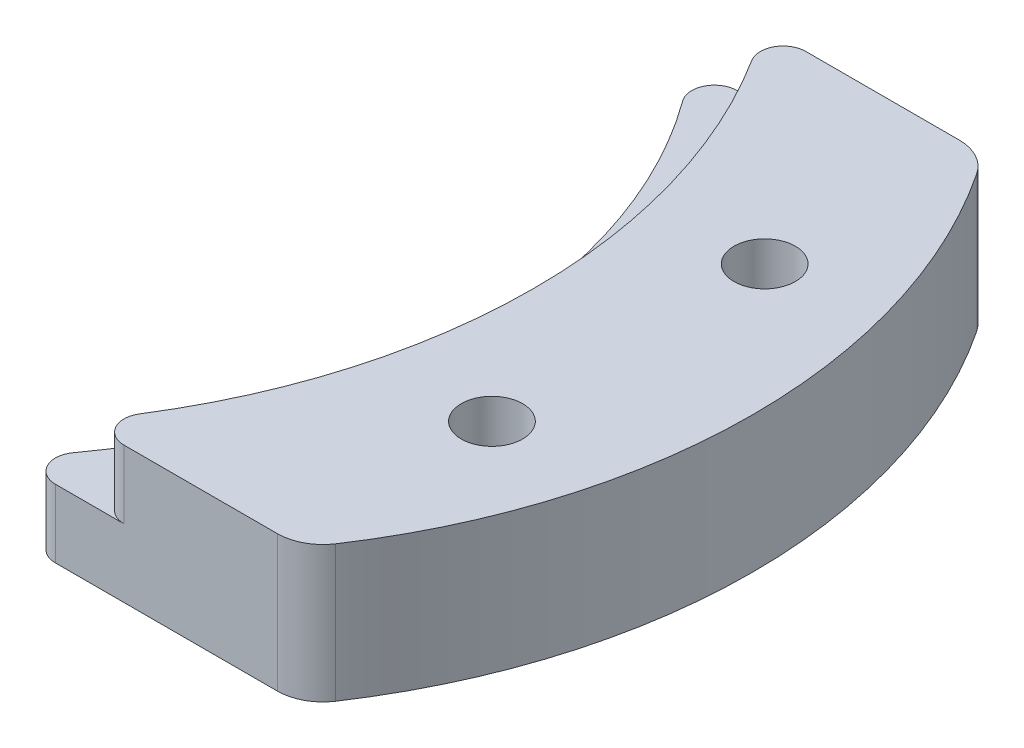
ISO-10303-21;
HEADER;
FILE_DESCRIPTION(('STEP AP214'),'2;1');
FILE_NAME('part.step','',(''),(''),'','','');
FILE_SCHEMA(('AUTOMOTIVE_DESIGN { 1 0 10303 214 1 1 1 1 }'));
ENDSEC;
DATA;
#1=APPLICATION_CONTEXT('core data for automotive mechanical design processes');
#2=APPLICATION_PROTOCOL_DEFINITION('international standard','automotive_design',2000,#1);
#3=PRODUCT_CONTEXT('',#1,'mechanical');
#4=PRODUCT('Part','Part','',(#3));
#5=PRODUCT_RELATED_PRODUCT_CATEGORY('part','',(#4));
#6=PRODUCT_DEFINITION_FORMATION('','',#4);
#7=PRODUCT_DEFINITION_CONTEXT('part definition',#1,'design');
#8=PRODUCT_DEFINITION('design','',#6,#7);
#9=PRODUCT_DEFINITION_SHAPE('','',#8);
#10=(LENGTH_UNIT() NAMED_UNIT(*) SI_UNIT(.MILLI.,.METRE.));
#11=(NAMED_UNIT(*) PLANE_ANGLE_UNIT() SI_UNIT($,.RADIAN.));
#12=(NAMED_UNIT(*) SI_UNIT($,.STERADIAN.) SOLID_ANGLE_UNIT());
#13=UNCERTAINTY_MEASURE_WITH_UNIT(LENGTH_MEASURE(1.E-05),#10,'distance_accuracy_value','');
#14=(GEOMETRIC_REPRESENTATION_CONTEXT(3) GLOBAL_UNCERTAINTY_ASSIGNED_CONTEXT((#13)) GLOBAL_UNIT_ASSIGNED_CONTEXT((#10,
#11,#12)) REPRESENTATION_CONTEXT('',''));
#15=CARTESIAN_POINT('',(0.,0.,0.));
#16=DIRECTION('',(0.,0.,1.));
#17=DIRECTION('',(1.,0.,0.));
#18=AXIS2_PLACEMENT_3D('',#15,#16,#17);
#19=CARTESIAN_POINT('',(0.,6.,0.));
#20=DIRECTION('',(0.,-1.,0.));
#21=DIRECTION('',(0.,0.,-1.));
#22=AXIS2_PLACEMENT_3D('',#19,#20,#21);
#23=CYLINDRICAL_SURFACE('',#22,22.75);
#24=CARTESIAN_POINT('',(0.,3.,0.));
#25=DIRECTION('',(0.,1.,0.));
#26=DIRECTION('',(0.,0.,1.));
#27=AXIS2_PLACEMENT_3D('',#24,#25,#26);
#28=CIRCLE('',#27,22.75);
#29=CARTESIAN_POINT('',(18.3771674621939,3.,13.4105263157895));
#30=VERTEX_POINT('',#29);
#31=CARTESIAN_POINT('',(18.3771674621939,3.,-13.4105263157895));
#32=VERTEX_POINT('',#31);
#33=EDGE_CURVE('E148',#30,#32,#28,.T.);
#34=ORIENTED_EDGE('',*,*,#33,.T.);
#35=DIRECTION('',(0.,-1.,0.));
#36=VECTOR('',#35,1.);
#37=CARTESIAN_POINT('',(18.3771674621939,6.,-13.4105263157895));
#38=LINE('',#37,#36);
#39=CARTESIAN_POINT('',(18.3771674621939,0.,-13.4105263157895));
#40=VERTEX_POINT('',#39);
#41=EDGE_CURVE('E163',#32,#40,#38,.T.);
#42=ORIENTED_EDGE('',*,*,#41,.T.);
#43=CARTESIAN_POINT('',(0.,0.,0.));
#44=DIRECTION('',(0.,1.,0.));
#45=DIRECTION('',(0.,0.,1.));
#46=AXIS2_PLACEMENT_3D('',#43,#44,#45);
#47=CIRCLE('',#46,22.75);
#48=CARTESIAN_POINT('',(18.3771674621939,0.,13.4105263157895));
#49=VERTEX_POINT('',#48);
#50=EDGE_CURVE('E255',#49,#40,#47,.T.);
#51=ORIENTED_EDGE('',*,*,#50,.F.);
#52=DIRECTION('',(0.,-1.,0.));
#53=VECTOR('',#52,1.);
#54=CARTESIAN_POINT('',(18.3771674621939,6.,13.4105263157895));
#55=LINE('',#54,#53);
#56=EDGE_CURVE('E156',#49,#30,#55,.F.);
#57=ORIENTED_EDGE('',*,*,#56,.T.);
#58=EDGE_LOOP('',(#34,#42,#51,#57));
#59=FACE_BOUND('',#58,.T.);
#60=ADVANCED_FACE('F36',(#59),#23,.F.);
#61=CARTESIAN_POINT('',(0.,6.,15.));
#62=DIRECTION('',(0.,0.,-1.));
#63=DIRECTION('',(-1.,0.,0.));
#64=AXIS2_PLACEMENT_3D('',#61,#62,#63);
#65=PLANE('',#64);
#66=DIRECTION('',(1.,0.,0.));
#67=VECTOR('',#66,1.);
#68=CARTESIAN_POINT('',(0.,0.,15.));
#69=LINE('',#68,#67);
#70=CARTESIAN_POINT('',(19.1849550429497,0.,15.));
#71=VERTEX_POINT('',#70);
#72=CARTESIAN_POINT('',(28.9551813231506,0.,15.));
#73=VERTEX_POINT('',#72);
#74=EDGE_CURVE('E236',#71,#73,#69,.T.);
#75=ORIENTED_EDGE('',*,*,#74,.T.);
#76=DIRECTION('',(0.,1.,0.));
#77=VECTOR('',#76,1.);
#78=CARTESIAN_POINT('',(28.9551813231506,6.,15.));
#79=LINE('',#78,#77);
#80=CARTESIAN_POINT('',(28.9551813231506,6.,15.));
#81=VERTEX_POINT('',#80);
#82=EDGE_CURVE('E51',#73,#81,#79,.T.);
#83=ORIENTED_EDGE('',*,*,#82,.T.);
#84=DIRECTION('',(1.,0.,0.));
#85=VECTOR('',#84,1.);
#86=CARTESIAN_POINT('',(0.,6.,15.));
#87=LINE('',#86,#85);
#88=CARTESIAN_POINT('',(22.2050106957867,6.,15.));
#89=VERTEX_POINT('',#88);
#90=EDGE_CURVE('E231',#89,#81,#87,.T.);
#91=ORIENTED_EDGE('',*,*,#90,.F.);
#92=DIRECTION('',(0.,1.,0.));
#93=VECTOR('',#92,1.);
#94=CARTESIAN_POINT('',(22.2050106957867,6.,15.));
#95=LINE('',#94,#93);
#96=CARTESIAN_POINT('',(22.2050106957867,3.,15.));
#97=VERTEX_POINT('',#96);
#98=EDGE_CURVE('E153',#89,#97,#95,.F.);
#99=ORIENTED_EDGE('',*,*,#98,.T.);
#100=DIRECTION('',(1.,0.,0.));
#101=VECTOR('',#100,1.);
#102=CARTESIAN_POINT('',(0.,3.,15.));
#103=LINE('',#102,#101);
#104=CARTESIAN_POINT('',(19.1849550429497,3.,15.));
#105=VERTEX_POINT('',#104);
#106=EDGE_CURVE('E258',#105,#97,#103,.T.);
#107=ORIENTED_EDGE('',*,*,#106,.F.);
#108=DIRECTION('',(0.,1.,0.));
#109=VECTOR('',#108,1.);
#110=CARTESIAN_POINT('',(19.1849550429497,0.,15.));
#111=LINE('',#110,#109);
#112=EDGE_CURVE('E174',#105,#71,#111,.F.);
#113=ORIENTED_EDGE('',*,*,#112,.T.);
#114=EDGE_LOOP('',(#75,#83,#91,#99,#107,#113));
#115=FACE_BOUND('',#114,.T.);
#116=ADVANCED_FACE('F292',(#115),#65,.F.);
#117=CARTESIAN_POINT('',(9.37840937269872,6.,0.));
#118=DIRECTION('',(0.,-1.,0.));
#119=DIRECTION('',(0.,0.,-1.));
#120=AXIS2_PLACEMENT_3D('',#117,#118,#119);
#121=CYLINDRICAL_SURFACE('',#120,25.5);
#122=CARTESIAN_POINT('',(9.37840937269872,0.,0.));
#123=DIRECTION('',(0.,1.,0.));
#124=DIRECTION('',(0.,0.,1.));
#125=AXIS2_PLACEMENT_3D('',#122,#123,#124);
#126=CIRCLE('',#125,25.5);
#127=CARTESIAN_POINT('',(30.6212895742529,0.,-14.1063829787234));
#128=VERTEX_POINT('',#127);
#129=CARTESIAN_POINT('',(30.6212895742529,0.,14.1063829787234));
#130=VERTEX_POINT('',#129);
#131=EDGE_CURVE('E232',#128,#130,#126,.F.);
#132=ORIENTED_EDGE('',*,*,#131,.F.);
#133=DIRECTION('',(0.,-1.,0.));
#134=VECTOR('',#133,1.);
#135=CARTESIAN_POINT('',(30.6212895742529,6.,-14.1063829787234));
#136=LINE('',#135,#134);
#137=CARTESIAN_POINT('',(30.6212895742529,6.,-14.1063829787234));
#138=VERTEX_POINT('',#137);
#139=EDGE_CURVE('E193',#128,#138,#136,.F.);
#140=ORIENTED_EDGE('',*,*,#139,.T.);
#141=CARTESIAN_POINT('',(9.37840937269872,6.,0.));
#142=DIRECTION('',(0.,1.,0.));
#143=DIRECTION('',(0.,0.,1.));
#144=AXIS2_PLACEMENT_3D('',#141,#142,#143);
#145=CIRCLE('',#144,25.5);
#146=CARTESIAN_POINT('',(30.6212895742529,6.,14.1063829787234));
#147=VERTEX_POINT('',#146);
#148=EDGE_CURVE('E234',#138,#147,#145,.F.);
#149=ORIENTED_EDGE('',*,*,#148,.T.);
#150=DIRECTION('',(0.,-1.,0.));
#151=VECTOR('',#150,1.);
#152=CARTESIAN_POINT('',(30.6212895742529,6.,14.1063829787234));
#153=LINE('',#152,#151);
#154=EDGE_CURVE('E190',#147,#130,#153,.T.);
#155=ORIENTED_EDGE('',*,*,#154,.T.);
#156=EDGE_LOOP('',(#132,#140,#149,#155));
#157=FACE_BOUND('',#156,.T.);
#158=ADVANCED_FACE('F297',(#157),#121,.T.);
#159=CARTESIAN_POINT('',(0.,6.,-15.));
#160=DIRECTION('',(0.,0.,-1.));
#161=DIRECTION('',(-1.,0.,0.));
#162=AXIS2_PLACEMENT_3D('',#159,#160,#161);
#163=PLANE('',#162);
#164=DIRECTION('',(1.,0.,0.));
#165=VECTOR('',#164,1.);
#166=CARTESIAN_POINT('',(0.,6.,-15.));
#167=LINE('',#166,#165);
#168=CARTESIAN_POINT('',(22.2050106957867,6.,-15.));
#169=VERTEX_POINT('',#168);
#170=CARTESIAN_POINT('',(28.9551813231506,6.,-15.));
#171=VERTEX_POINT('',#170);
#172=EDGE_CURVE('E240',#169,#171,#167,.T.);
#173=ORIENTED_EDGE('',*,*,#172,.T.);
#174=DIRECTION('',(0.,-1.,0.));
#175=VECTOR('',#174,1.);
#176=CARTESIAN_POINT('',(28.9551813231506,6.,-15.));
#177=LINE('',#176,#175);
#178=CARTESIAN_POINT('',(28.9551813231506,0.,-15.));
#179=VERTEX_POINT('',#178);
#180=EDGE_CURVE('E183',#171,#179,#177,.T.);
#181=ORIENTED_EDGE('',*,*,#180,.T.);
#182=DIRECTION('',(1.,0.,0.));
#183=VECTOR('',#182,1.);
#184=CARTESIAN_POINT('',(0.,0.,-15.));
#185=LINE('',#184,#183);
#186=CARTESIAN_POINT('',(19.1849550429497,0.,-15.));
#187=VERTEX_POINT('',#186);
#188=EDGE_CURVE('E225',#187,#179,#185,.T.);
#189=ORIENTED_EDGE('',*,*,#188,.F.);
#190=DIRECTION('',(0.,-1.,0.));
#191=VECTOR('',#190,1.);
#192=CARTESIAN_POINT('',(19.1849550429497,6.,-15.));
#193=LINE('',#192,#191);
#194=CARTESIAN_POINT('',(19.1849550429497,3.,-15.));
#195=VERTEX_POINT('',#194);
#196=EDGE_CURVE('E158',#187,#195,#193,.F.);
#197=ORIENTED_EDGE('',*,*,#196,.T.);
#198=DIRECTION('',(1.,0.,0.));
#199=VECTOR('',#198,1.);
#200=CARTESIAN_POINT('',(0.,3.,-15.));
#201=LINE('',#200,#199);
#202=CARTESIAN_POINT('',(22.2050106957867,3.,-15.));
#203=VERTEX_POINT('',#202);
#204=EDGE_CURVE('E141',#195,#203,#201,.T.);
#205=ORIENTED_EDGE('',*,*,#204,.T.);
#206=DIRECTION('',(0.,-1.,0.));
#207=VECTOR('',#206,1.);
#208=CARTESIAN_POINT('',(22.2050106957867,6.,-15.));
#209=LINE('',#208,#207);
#210=EDGE_CURVE('E154',#203,#169,#209,.F.);
#211=ORIENTED_EDGE('',*,*,#210,.T.);
#212=EDGE_LOOP('',(#173,#181,#189,#197,#205,#211));
#213=FACE_BOUND('',#212,.T.);
#214=ADVANCED_FACE('F244',(#213),#163,.T.);
#215=CARTESIAN_POINT('',(0.,6.,0.));
#216=DIRECTION('',(0.,1.,0.));
#217=DIRECTION('',(0.,0.,1.));
#218=AXIS2_PLACEMENT_3D('',#215,#216,#217);
#219=PLANE('',#218);
#220=CARTESIAN_POINT('',(29.3938769133981,6.,-6.));
#221=DIRECTION('',(0.,1.,0.));
#222=DIRECTION('',(0.,0.,1.));
#223=AXIS2_PLACEMENT_3D('',#220,#221,#222);
#224=CIRCLE('',#223,1.35);
#225=CARTESIAN_POINT('',(29.3938769133981,6.,-4.65));
#226=VERTEX_POINT('',#225);
#227=EDGE_CURVE('E266',#226,#226,#224,.T.);
#228=ORIENTED_EDGE('',*,*,#227,.F.);
#229=EDGE_LOOP('',(#228));
#230=FACE_BOUND('',#229,.T.);
#231=CARTESIAN_POINT('',(29.3938769133981,6.,6.));
#232=DIRECTION('',(0.,1.,0.));
#233=DIRECTION('',(0.,0.,-1.));
#234=AXIS2_PLACEMENT_3D('',#231,#232,#233);
#235=CIRCLE('',#234,1.35);
#236=CARTESIAN_POINT('',(29.3938769133981,6.,4.65));
#237=VERTEX_POINT('',#236);
#238=EDGE_CURVE('E267',#237,#237,#235,.T.);
#239=ORIENTED_EDGE('',*,*,#238,.F.);
#240=EDGE_LOOP('',(#239));
#241=FACE_BOUND('',#240,.T.);
#242=ORIENTED_EDGE('',*,*,#148,.F.);
#243=CARTESIAN_POINT('',(28.9551813231506,6.,-13.));
#244=DIRECTION('',(0.,1.,0.));
#245=DIRECTION('',(0.,0.,1.));
#246=AXIS2_PLACEMENT_3D('',#243,#244,#245);
#247=CIRCLE('',#246,2.);
#248=EDGE_CURVE('E196',#138,#171,#247,.T.);
#249=ORIENTED_EDGE('',*,*,#248,.T.);
#250=ORIENTED_EDGE('',*,*,#172,.F.);
#251=CARTESIAN_POINT('',(22.2050106957867,6.,-14.));
#252=DIRECTION('',(0.,1.,0.));
#253=DIRECTION('',(0.,0.,1.));
#254=AXIS2_PLACEMENT_3D('',#251,#252,#253);
#255=CIRCLE('',#254,1.);
#256=CARTESIAN_POINT('',(21.3591055264234,6.,-13.4666666666667));
#257=VERTEX_POINT('',#256);
#258=EDGE_CURVE('E147',#169,#257,#255,.T.);
#259=ORIENTED_EDGE('',*,*,#258,.T.);
#260=CARTESIAN_POINT('',(0.,6.,0.));
#261=DIRECTION('',(0.,1.,0.));
#262=DIRECTION('',(0.,0.,1.));
#263=AXIS2_PLACEMENT_3D('',#260,#261,#262);
#264=CIRCLE('',#263,25.25);
#265=CARTESIAN_POINT('',(21.3591055264234,6.,13.4666666666667));
#266=VERTEX_POINT('',#265);
#267=EDGE_CURVE('E133',#266,#257,#264,.T.);
#268=ORIENTED_EDGE('',*,*,#267,.F.);
#269=CARTESIAN_POINT('',(22.2050106957867,6.,14.));
#270=DIRECTION('',(0.,1.,0.));
#271=DIRECTION('',(0.,0.,1.));
#272=AXIS2_PLACEMENT_3D('',#269,#270,#271);
#273=CIRCLE('',#272,1.);
#274=EDGE_CURVE('E144',#266,#89,#273,.T.);
#275=ORIENTED_EDGE('',*,*,#274,.T.);
#276=ORIENTED_EDGE('',*,*,#90,.T.);
#277=CARTESIAN_POINT('',(28.9551813231506,6.,13.));
#278=DIRECTION('',(0.,1.,0.));
#279=DIRECTION('',(0.,0.,1.));
#280=AXIS2_PLACEMENT_3D('',#277,#278,#279);
#281=CIRCLE('',#280,2.);
#282=EDGE_CURVE('E58',#81,#147,#281,.T.);
#283=ORIENTED_EDGE('',*,*,#282,.T.);
#284=EDGE_LOOP('',(#242,#249,#250,#259,#268,#275,#276,#283));
#285=FACE_BOUND('',#284,.T.);
#286=ADVANCED_FACE('F143',(#230,#241,#285),#219,.T.);
#287=CARTESIAN_POINT('',(0.,0.,0.));
#288=DIRECTION('',(0.,1.,0.));
#289=DIRECTION('',(0.,0.,1.));
#290=AXIS2_PLACEMENT_3D('',#287,#288,#289);
#291=PLANE('',#290);
#292=CARTESIAN_POINT('',(29.3938769133981,0.,6.));
#293=DIRECTION('',(0.,1.,0.));
#294=DIRECTION('',(0.,0.,1.));
#295=AXIS2_PLACEMENT_3D('',#292,#293,#294);
#296=CIRCLE('',#295,2.85000000000001);
#297=CARTESIAN_POINT('',(29.3938769133981,0.,8.85000000000001));
#298=VERTEX_POINT('',#297);
#299=EDGE_CURVE('E202',#298,#298,#296,.T.);
#300=ORIENTED_EDGE('',*,*,#299,.T.);
#301=EDGE_LOOP('',(#300));
#302=FACE_BOUND('',#301,.T.);
#303=CARTESIAN_POINT('',(29.3938769133981,0.,-6.));
#304=DIRECTION('',(0.,1.,0.));
#305=DIRECTION('',(0.,0.,1.));
#306=AXIS2_PLACEMENT_3D('',#303,#304,#305);
#307=CIRCLE('',#306,2.85000000000001);
#308=CARTESIAN_POINT('',(29.3938769133981,0.,-3.14999999999999));
#309=VERTEX_POINT('',#308);
#310=EDGE_CURVE('E199',#309,#309,#307,.T.);
#311=ORIENTED_EDGE('',*,*,#310,.T.);
#312=EDGE_LOOP('',(#311));
#313=FACE_BOUND('',#312,.T.);
#314=ORIENTED_EDGE('',*,*,#188,.T.);
#315=CARTESIAN_POINT('',(28.9551813231506,0.,-13.));
#316=DIRECTION('',(0.,1.,0.));
#317=DIRECTION('',(0.,0.,1.));
#318=AXIS2_PLACEMENT_3D('',#315,#316,#317);
#319=CIRCLE('',#318,2.);
#320=EDGE_CURVE('E188',#179,#128,#319,.F.);
#321=ORIENTED_EDGE('',*,*,#320,.T.);
#322=ORIENTED_EDGE('',*,*,#131,.T.);
#323=CARTESIAN_POINT('',(28.9551813231506,0.,13.));
#324=DIRECTION('',(0.,1.,0.));
#325=DIRECTION('',(0.,0.,1.));
#326=AXIS2_PLACEMENT_3D('',#323,#324,#325);
#327=CIRCLE('',#326,2.);
#328=EDGE_CURVE('E186',#130,#73,#327,.F.);
#329=ORIENTED_EDGE('',*,*,#328,.T.);
#330=ORIENTED_EDGE('',*,*,#74,.F.);
#331=CARTESIAN_POINT('',(19.1849550429497,0.,14.));
#332=DIRECTION('',(0.,1.,0.));
#333=DIRECTION('',(0.,0.,1.));
#334=AXIS2_PLACEMENT_3D('',#331,#332,#333);
#335=CIRCLE('',#334,1.);
#336=EDGE_CURVE('E166',#71,#49,#335,.F.);
#337=ORIENTED_EDGE('',*,*,#336,.T.);
#338=ORIENTED_EDGE('',*,*,#50,.T.);
#339=CARTESIAN_POINT('',(19.1849550429497,0.,-14.));
#340=DIRECTION('',(0.,1.,0.));
#341=DIRECTION('',(0.,0.,1.));
#342=AXIS2_PLACEMENT_3D('',#339,#340,#341);
#343=CIRCLE('',#342,1.);
#344=EDGE_CURVE('E168',#40,#187,#343,.F.);
#345=ORIENTED_EDGE('',*,*,#344,.T.);
#346=EDGE_LOOP('',(#314,#321,#322,#329,#330,#337,#338,#345));
#347=FACE_BOUND('',#346,.T.);
#348=ADVANCED_FACE('F216',(#302,#313,#347),#291,.F.);
#349=CARTESIAN_POINT('',(0.,3.,0.));
#350=DIRECTION('',(0.,1.,0.));
#351=DIRECTION('',(0.,0.,1.));
#352=AXIS2_PLACEMENT_3D('',#349,#350,#351);
#353=PLANE('',#352);
#354=ORIENTED_EDGE('',*,*,#204,.F.);
#355=CARTESIAN_POINT('',(19.1849550429497,3.,-14.));
#356=DIRECTION('',(0.,1.,0.));
#357=DIRECTION('',(0.,0.,1.));
#358=AXIS2_PLACEMENT_3D('',#355,#356,#357);
#359=CIRCLE('',#358,1.);
#360=EDGE_CURVE('E172',#195,#32,#359,.T.);
#361=ORIENTED_EDGE('',*,*,#360,.T.);
#362=ORIENTED_EDGE('',*,*,#33,.F.);
#363=CARTESIAN_POINT('',(19.1849550429497,3.,14.));
#364=DIRECTION('',(0.,1.,0.));
#365=DIRECTION('',(0.,0.,1.));
#366=AXIS2_PLACEMENT_3D('',#363,#364,#365);
#367=CIRCLE('',#366,1.);
#368=EDGE_CURVE('E170',#30,#105,#367,.T.);
#369=ORIENTED_EDGE('',*,*,#368,.T.);
#370=ORIENTED_EDGE('',*,*,#106,.T.);
#371=CARTESIAN_POINT('',(22.2050106957867,3.,14.));
#372=DIRECTION('',(0.,1.,0.));
#373=DIRECTION('',(0.,0.,1.));
#374=AXIS2_PLACEMENT_3D('',#371,#372,#373);
#375=CIRCLE('',#374,1.);
#376=CARTESIAN_POINT('',(21.3591055264234,3.,13.4666666666667));
#377=VERTEX_POINT('',#376);
#378=EDGE_CURVE('E181',#97,#377,#375,.F.);
#379=ORIENTED_EDGE('',*,*,#378,.T.);
#380=CARTESIAN_POINT('',(0.,3.,0.));
#381=DIRECTION('',(0.,1.,0.));
#382=DIRECTION('',(0.,0.,1.));
#383=AXIS2_PLACEMENT_3D('',#380,#381,#382);
#384=CIRCLE('',#383,25.25);
#385=CARTESIAN_POINT('',(21.3591055264234,3.,-13.4666666666667));
#386=VERTEX_POINT('',#385);
#387=EDGE_CURVE('E136',#377,#386,#384,.T.);
#388=ORIENTED_EDGE('',*,*,#387,.T.);
#389=CARTESIAN_POINT('',(22.2050106957867,3.,-14.));
#390=DIRECTION('',(0.,1.,0.));
#391=DIRECTION('',(0.,0.,1.));
#392=AXIS2_PLACEMENT_3D('',#389,#390,#391);
#393=CIRCLE('',#392,1.);
#394=EDGE_CURVE('E178',#386,#203,#393,.F.);
#395=ORIENTED_EDGE('',*,*,#394,.T.);
#396=EDGE_LOOP('',(#354,#361,#362,#369,#370,#379,#388,#395));
#397=FACE_BOUND('',#396,.T.);
#398=ADVANCED_FACE('F219',(#397),#353,.T.);
#399=CARTESIAN_POINT('',(0.,3.,0.));
#400=DIRECTION('',(0.,1.,0.));
#401=DIRECTION('',(0.,0.,1.));
#402=AXIS2_PLACEMENT_3D('',#399,#400,#401);
#403=CYLINDRICAL_SURFACE('',#402,25.25);
#404=ORIENTED_EDGE('',*,*,#267,.T.);
#405=DIRECTION('',(0.,1.,0.));
#406=VECTOR('',#405,1.);
#407=CARTESIAN_POINT('',(21.3591055264234,3.,-13.4666666666667));
#408=LINE('',#407,#406);
#409=EDGE_CURVE('E140',#257,#386,#408,.F.);
#410=ORIENTED_EDGE('',*,*,#409,.T.);
#411=ORIENTED_EDGE('',*,*,#387,.F.);
#412=DIRECTION('',(0.,1.,0.));
#413=VECTOR('',#412,1.);
#414=CARTESIAN_POINT('',(21.3591055264234,3.,13.4666666666667));
#415=LINE('',#414,#413);
#416=EDGE_CURVE('E129',#377,#266,#415,.T.);
#417=ORIENTED_EDGE('',*,*,#416,.T.);
#418=EDGE_LOOP('',(#404,#410,#411,#417));
#419=FACE_BOUND('',#418,.T.);
#420=ADVANCED_FACE('F131',(#419),#403,.F.);
#421=CARTESIAN_POINT('',(22.2050106957867,3.,-14.));
#422=DIRECTION('',(0.,1.,0.));
#423=DIRECTION('',(0.,0.,1.));
#424=AXIS2_PLACEMENT_3D('',#421,#422,#423);
#425=CYLINDRICAL_SURFACE('',#424,1.);
#426=ORIENTED_EDGE('',*,*,#258,.F.);
#427=ORIENTED_EDGE('',*,*,#210,.F.);
#428=ORIENTED_EDGE('',*,*,#394,.F.);
#429=ORIENTED_EDGE('',*,*,#409,.F.);
#430=EDGE_LOOP('',(#426,#427,#428,#429));
#431=FACE_BOUND('',#430,.T.);
#432=ADVANCED_FACE('F301',(#431),#425,.T.);
#433=CARTESIAN_POINT('',(19.1849550429497,6.,-14.));
#434=DIRECTION('',(0.,-1.,0.));
#435=DIRECTION('',(0.,0.,-1.));
#436=AXIS2_PLACEMENT_3D('',#433,#434,#435);
#437=CYLINDRICAL_SURFACE('',#436,1.);
#438=ORIENTED_EDGE('',*,*,#360,.F.);
#439=ORIENTED_EDGE('',*,*,#196,.F.);
#440=ORIENTED_EDGE('',*,*,#344,.F.);
#441=ORIENTED_EDGE('',*,*,#41,.F.);
#442=EDGE_LOOP('',(#438,#439,#440,#441));
#443=FACE_BOUND('',#442,.T.);
#444=ADVANCED_FACE('F252',(#443),#437,.T.);
#445=CARTESIAN_POINT('',(22.2050106957867,3.,14.));
#446=DIRECTION('',(0.,1.,0.));
#447=DIRECTION('',(0.,0.,1.));
#448=AXIS2_PLACEMENT_3D('',#445,#446,#447);
#449=CYLINDRICAL_SURFACE('',#448,1.);
#450=ORIENTED_EDGE('',*,*,#274,.F.);
#451=ORIENTED_EDGE('',*,*,#416,.F.);
#452=ORIENTED_EDGE('',*,*,#378,.F.);
#453=ORIENTED_EDGE('',*,*,#98,.F.);
#454=EDGE_LOOP('',(#450,#451,#452,#453));
#455=FACE_BOUND('',#454,.T.);
#456=ADVANCED_FACE('F151',(#455),#449,.T.);
#457=CARTESIAN_POINT('',(19.1849550429497,6.,14.));
#458=DIRECTION('',(0.,-1.,0.));
#459=DIRECTION('',(0.,0.,-1.));
#460=AXIS2_PLACEMENT_3D('',#457,#458,#459);
#461=CYLINDRICAL_SURFACE('',#460,1.);
#462=ORIENTED_EDGE('',*,*,#368,.F.);
#463=ORIENTED_EDGE('',*,*,#56,.F.);
#464=ORIENTED_EDGE('',*,*,#336,.F.);
#465=ORIENTED_EDGE('',*,*,#112,.F.);
#466=EDGE_LOOP('',(#462,#463,#464,#465));
#467=FACE_BOUND('',#466,.T.);
#468=ADVANCED_FACE('F309',(#467),#461,.T.);
#469=CARTESIAN_POINT('',(28.9551813231506,6.,-13.));
#470=DIRECTION('',(0.,-1.,0.));
#471=DIRECTION('',(0.,0.,-1.));
#472=AXIS2_PLACEMENT_3D('',#469,#470,#471);
#473=CYLINDRICAL_SURFACE('',#472,2.);
#474=ORIENTED_EDGE('',*,*,#248,.F.);
#475=ORIENTED_EDGE('',*,*,#139,.F.);
#476=ORIENTED_EDGE('',*,*,#320,.F.);
#477=ORIENTED_EDGE('',*,*,#180,.F.);
#478=EDGE_LOOP('',(#474,#475,#476,#477));
#479=FACE_BOUND('',#478,.T.);
#480=ADVANCED_FACE('F287',(#479),#473,.T.);
#481=CARTESIAN_POINT('',(28.9551813231506,6.,13.));
#482=DIRECTION('',(0.,-1.,0.));
#483=DIRECTION('',(0.,0.,-1.));
#484=AXIS2_PLACEMENT_3D('',#481,#482,#483);
#485=CYLINDRICAL_SURFACE('',#484,2.);
#486=ORIENTED_EDGE('',*,*,#282,.F.);
#487=ORIENTED_EDGE('',*,*,#82,.F.);
#488=ORIENTED_EDGE('',*,*,#328,.F.);
#489=ORIENTED_EDGE('',*,*,#154,.F.);
#490=EDGE_LOOP('',(#486,#487,#488,#489));
#491=FACE_BOUND('',#490,.T.);
#492=ADVANCED_FACE('F279',(#491),#485,.T.);
#493=CARTESIAN_POINT('',(29.3938769133981,0.,6.));
#494=DIRECTION('',(0.,1.,0.));
#495=DIRECTION('',(0.,0.,1.));
#496=AXIS2_PLACEMENT_3D('',#493,#494,#495);
#497=CYLINDRICAL_SURFACE('',#496,1.35);
#498=CARTESIAN_POINT('',(29.3938769133981,1.50000000000001,6.));
#499=DIRECTION('',(0.,1.,0.));
#500=DIRECTION('',(0.,0.,1.));
#501=AXIS2_PLACEMENT_3D('',#498,#499,#500);
#502=CIRCLE('',#501,1.35);
#503=CARTESIAN_POINT('',(29.3938769133981,1.50000000000001,7.35));
#504=VERTEX_POINT('',#503);
#505=EDGE_CURVE('E44',#504,#504,#502,.F.);
#506=ORIENTED_EDGE('',*,*,#505,.T.);
#507=EDGE_LOOP('',(#506));
#508=FACE_BOUND('',#507,.T.);
#509=ORIENTED_EDGE('',*,*,#238,.T.);
#510=EDGE_LOOP('',(#509));
#511=FACE_BOUND('',#510,.T.);
#512=ADVANCED_FACE('F207',(#508,#511),#497,.F.);
#513=CARTESIAN_POINT('',(29.3938769133981,0.,-6.));
#514=DIRECTION('',(0.,1.,0.));
#515=DIRECTION('',(0.,0.,1.));
#516=AXIS2_PLACEMENT_3D('',#513,#514,#515);
#517=CYLINDRICAL_SURFACE('',#516,1.35);
#518=CARTESIAN_POINT('',(29.3938769133981,1.50000000000001,-6.));
#519=DIRECTION('',(0.,1.,0.));
#520=DIRECTION('',(0.,0.,1.));
#521=AXIS2_PLACEMENT_3D('',#518,#519,#520);
#522=CIRCLE('',#521,1.35);
#523=CARTESIAN_POINT('',(29.3938769133981,1.50000000000001,-4.65));
#524=VERTEX_POINT('',#523);
#525=EDGE_CURVE('E11',#524,#524,#522,.F.);
#526=ORIENTED_EDGE('',*,*,#525,.T.);
#527=EDGE_LOOP('',(#526));
#528=FACE_BOUND('',#527,.T.);
#529=ORIENTED_EDGE('',*,*,#227,.T.);
#530=EDGE_LOOP('',(#529));
#531=FACE_BOUND('',#530,.T.);
#532=ADVANCED_FACE('F213',(#528,#531),#517,.F.);
#533=CARTESIAN_POINT('',(29.3938769133981,0.,6.));
#534=DIRECTION('',(0.,-1.,0.));
#535=DIRECTION('',(0.,0.,-1.));
#536=AXIS2_PLACEMENT_3D('',#533,#534,#535);
#537=CONICAL_SURFACE('',#536,2.85000000000001,0.785398163397448);
#538=ORIENTED_EDGE('',*,*,#505,.F.);
#539=EDGE_LOOP('',(#538));
#540=FACE_BOUND('',#539,.T.);
#541=ORIENTED_EDGE('',*,*,#299,.F.);
#542=EDGE_LOOP('',(#541));
#543=FACE_BOUND('',#542,.T.);
#544=ADVANCED_FACE('F210',(#540,#543),#537,.F.);
#545=CARTESIAN_POINT('',(29.3938769133981,0.,-6.));
#546=DIRECTION('',(0.,-1.,0.));
#547=DIRECTION('',(0.,0.,-1.));
#548=AXIS2_PLACEMENT_3D('',#545,#546,#547);
#549=CONICAL_SURFACE('',#548,2.85000000000001,0.785398163397448);
#550=ORIENTED_EDGE('',*,*,#525,.F.);
#551=EDGE_LOOP('',(#550));
#552=FACE_BOUND('',#551,.T.);
#553=ORIENTED_EDGE('',*,*,#310,.F.);
#554=EDGE_LOOP('',(#553));
#555=FACE_BOUND('',#554,.T.);
#556=ADVANCED_FACE('F38',(#552,#555),#549,.F.);
#557=CLOSED_SHELL('',(#60,#116,#158,#214,#286,#348,#398,#420,#432,#444,#456,#468,#480,#492,#512,
#532,#544,#556));
#558=MANIFOLD_SOLID_BREP('B2',#557);
#559=ADVANCED_BREP_SHAPE_REPRESENTATION('',(#18,#558),#14);
#560=SHAPE_DEFINITION_REPRESENTATION(#9,#559);
ENDSEC;
END-ISO-10303-21;
